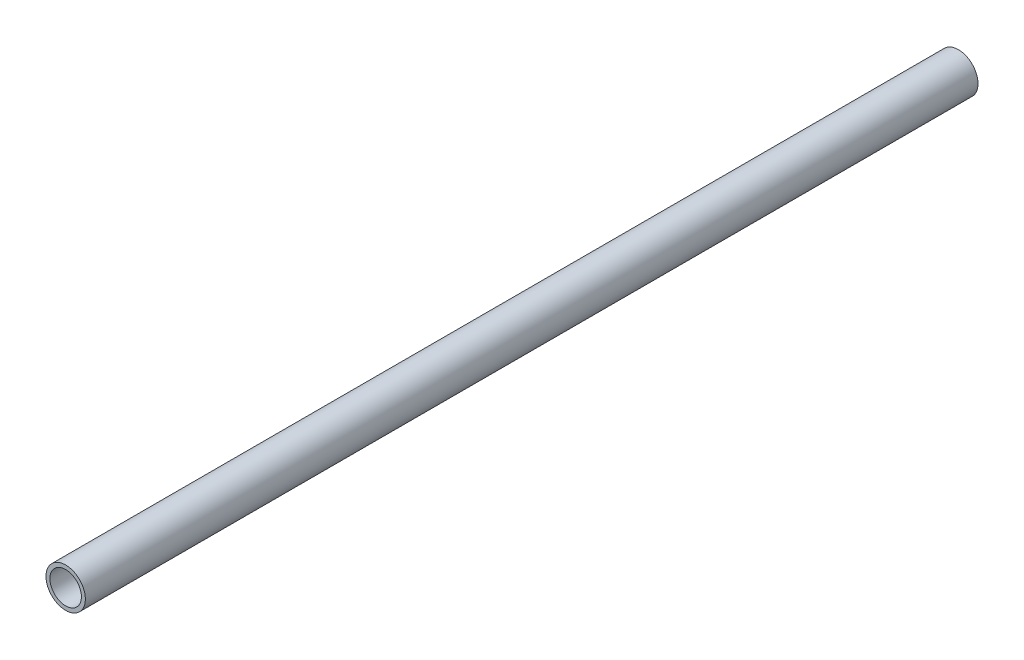
ISO-10303-21;
HEADER;
FILE_DESCRIPTION(('STEP AP214'),'2;1');
FILE_NAME('part.step','',(''),(''),'','','');
FILE_SCHEMA(('AUTOMOTIVE_DESIGN { 1 0 10303 214 1 1 1 1 }'));
ENDSEC;
DATA;
#1=APPLICATION_CONTEXT('core data for automotive mechanical design processes');
#2=APPLICATION_PROTOCOL_DEFINITION('international standard','automotive_design',2000,#1);
#3=PRODUCT_CONTEXT('',#1,'mechanical');
#4=PRODUCT('Part','Part','',(#3));
#5=PRODUCT_RELATED_PRODUCT_CATEGORY('part','',(#4));
#6=PRODUCT_DEFINITION_FORMATION('','',#4);
#7=PRODUCT_DEFINITION_CONTEXT('part definition',#1,'design');
#8=PRODUCT_DEFINITION('design','',#6,#7);
#9=PRODUCT_DEFINITION_SHAPE('','',#8);
#10=(LENGTH_UNIT() NAMED_UNIT(*) SI_UNIT(.MILLI.,.METRE.));
#11=(NAMED_UNIT(*) PLANE_ANGLE_UNIT() SI_UNIT($,.RADIAN.));
#12=(NAMED_UNIT(*) SI_UNIT($,.STERADIAN.) SOLID_ANGLE_UNIT());
#13=UNCERTAINTY_MEASURE_WITH_UNIT(LENGTH_MEASURE(1.E-05),#10,'distance_accuracy_value','');
#14=(GEOMETRIC_REPRESENTATION_CONTEXT(3) GLOBAL_UNCERTAINTY_ASSIGNED_CONTEXT((#13)) GLOBAL_UNIT_ASSIGNED_CONTEXT((#10,
#11,#12)) REPRESENTATION_CONTEXT('',''));
#15=CARTESIAN_POINT('',(0.,0.,0.));
#16=DIRECTION('',(0.,0.,1.));
#17=DIRECTION('',(1.,0.,0.));
#18=AXIS2_PLACEMENT_3D('',#15,#16,#17);
#19=CARTESIAN_POINT('',(30.,0.,-61.2132034355964));
#20=DIRECTION('',(0.,0.,1.));
#21=DIRECTION('',(1.,0.,0.));
#22=AXIS2_PLACEMENT_3D('',#19,#20,#21);
#23=CYLINDRICAL_SURFACE('',#22,7.5);
#24=CARTESIAN_POINT('',(30.,0.,-40.));
#25=DIRECTION('',(0.,0.,-1.));
#26=DIRECTION('',(-1.,0.,0.));
#27=AXIS2_PLACEMENT_3D('',#24,#25,#26);
#28=CIRCLE('',#27,7.5);
#29=CARTESIAN_POINT('',(22.5,0.,-40.));
#30=VERTEX_POINT('',#29);
#31=EDGE_CURVE('E37',#30,#30,#28,.F.);
#32=ORIENTED_EDGE('',*,*,#31,.T.);
#33=EDGE_LOOP('',(#32));
#34=FACE_BOUND('',#33,.T.);
#35=CARTESIAN_POINT('',(30.,0.,300.));
#36=DIRECTION('',(0.,0.,1.));
#37=DIRECTION('',(1.,0.,0.));
#38=AXIS2_PLACEMENT_3D('',#35,#36,#37);
#39=CIRCLE('',#38,7.5);
#40=CARTESIAN_POINT('',(37.5,0.,300.));
#41=VERTEX_POINT('',#40);
#42=EDGE_CURVE('E44',#41,#41,#39,.T.);
#43=ORIENTED_EDGE('',*,*,#42,.F.);
#44=EDGE_LOOP('',(#43));
#45=FACE_BOUND('',#44,.T.);
#46=ADVANCED_FACE('F33',(#34,#45),#23,.T.);
#47=CARTESIAN_POINT('',(30.,0.,-61.2132034355964));
#48=DIRECTION('',(0.,0.,1.));
#49=DIRECTION('',(1.,0.,0.));
#50=AXIS2_PLACEMENT_3D('',#47,#48,#49);
#51=CYLINDRICAL_SURFACE('',#50,6.);
#52=CARTESIAN_POINT('',(30.,0.,-40.));
#53=DIRECTION('',(0.,0.,-1.));
#54=DIRECTION('',(-1.,0.,0.));
#55=AXIS2_PLACEMENT_3D('',#52,#53,#54);
#56=CIRCLE('',#55,6.);
#57=CARTESIAN_POINT('',(24.,0.,-40.));
#58=VERTEX_POINT('',#57);
#59=EDGE_CURVE('E10',#58,#58,#56,.F.);
#60=ORIENTED_EDGE('',*,*,#59,.F.);
#61=EDGE_LOOP('',(#60));
#62=FACE_BOUND('',#61,.T.);
#63=CARTESIAN_POINT('',(30.,0.,300.));
#64=DIRECTION('',(0.,0.,1.));
#65=DIRECTION('',(1.,0.,0.));
#66=AXIS2_PLACEMENT_3D('',#63,#64,#65);
#67=CIRCLE('',#66,6.);
#68=CARTESIAN_POINT('',(36.,0.,300.));
#69=VERTEX_POINT('',#68);
#70=EDGE_CURVE('E48',#69,#69,#67,.T.);
#71=ORIENTED_EDGE('',*,*,#70,.T.);
#72=EDGE_LOOP('',(#71));
#73=FACE_BOUND('',#72,.T.);
#74=ADVANCED_FACE('F52',(#62,#73),#51,.F.);
#75=CARTESIAN_POINT('',(0.,0.,-40.));
#76=DIRECTION('',(0.,0.,-1.));
#77=DIRECTION('',(-1.,0.,0.));
#78=AXIS2_PLACEMENT_3D('',#75,#76,#77);
#79=PLANE('',#78);
#80=ORIENTED_EDGE('',*,*,#31,.F.);
#81=EDGE_LOOP('',(#80));
#82=FACE_BOUND('',#81,.T.);
#83=ORIENTED_EDGE('',*,*,#59,.T.);
#84=EDGE_LOOP('',(#83));
#85=FACE_BOUND('',#84,.T.);
#86=ADVANCED_FACE('F35',(#82,#85),#79,.T.);
#87=CARTESIAN_POINT('',(30.,0.,300.));
#88=DIRECTION('',(0.,0.,1.));
#89=DIRECTION('',(1.,0.,0.));
#90=AXIS2_PLACEMENT_3D('',#87,#88,#89);
#91=PLANE('',#90);
#92=ORIENTED_EDGE('',*,*,#42,.T.);
#93=EDGE_LOOP('',(#92));
#94=FACE_BOUND('',#93,.T.);
#95=ORIENTED_EDGE('',*,*,#70,.F.);
#96=EDGE_LOOP('',(#95));
#97=FACE_BOUND('',#96,.T.);
#98=ADVANCED_FACE('F54',(#94,#97),#91,.T.);
#99=CLOSED_SHELL('',(#46,#74,#86,#98));
#100=MANIFOLD_SOLID_BREP('B2',#99);
#101=ADVANCED_BREP_SHAPE_REPRESENTATION('',(#18,#100),#14);
#102=SHAPE_DEFINITION_REPRESENTATION(#9,#101);
ENDSEC;
END-ISO-10303-21;
